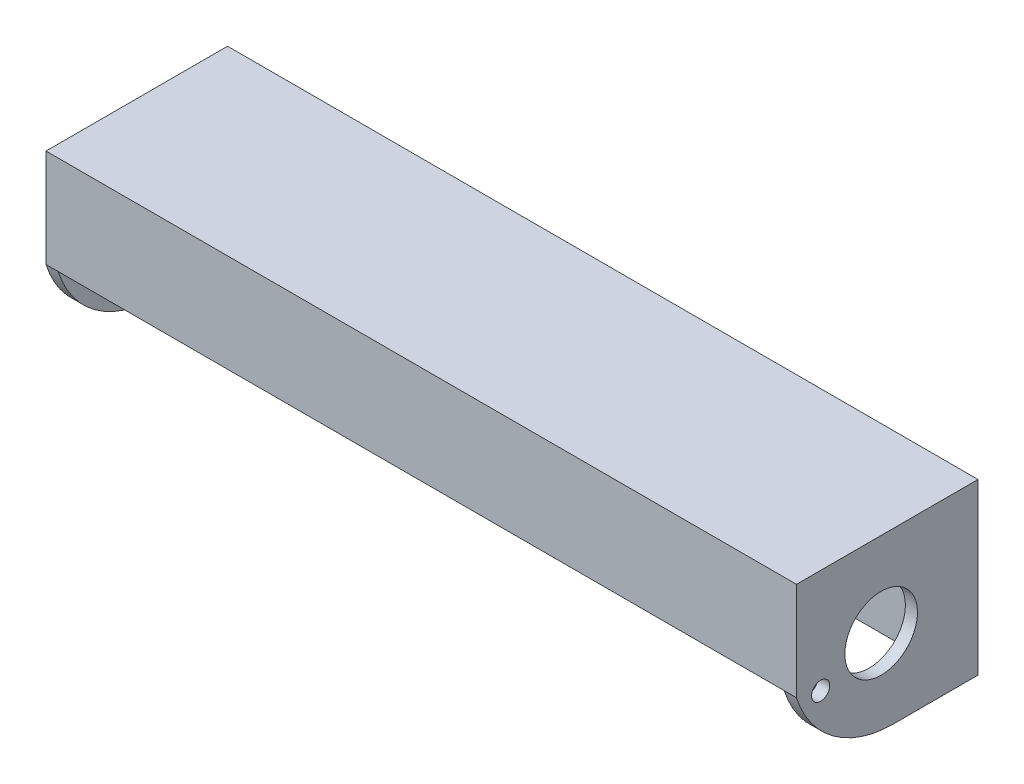
ISO-10303-21;
HEADER;
FILE_DESCRIPTION(('STEP AP214'),'2;1');
FILE_NAME('part.step','',(''),(''),'','','');
FILE_SCHEMA(('AUTOMOTIVE_DESIGN { 1 0 10303 214 1 1 1 1 }'));
ENDSEC;
DATA;
#1=APPLICATION_CONTEXT('core data for automotive mechanical design processes');
#2=APPLICATION_PROTOCOL_DEFINITION('international standard','automotive_design',2000,#1);
#3=PRODUCT_CONTEXT('',#1,'mechanical');
#4=PRODUCT('Part','Part','',(#3));
#5=PRODUCT_RELATED_PRODUCT_CATEGORY('part','',(#4));
#6=PRODUCT_DEFINITION_FORMATION('','',#4);
#7=PRODUCT_DEFINITION_CONTEXT('part definition',#1,'design');
#8=PRODUCT_DEFINITION('design','',#6,#7);
#9=PRODUCT_DEFINITION_SHAPE('','',#8);
#10=(LENGTH_UNIT() NAMED_UNIT(*) SI_UNIT(.MILLI.,.METRE.));
#11=(NAMED_UNIT(*) PLANE_ANGLE_UNIT() SI_UNIT($,.RADIAN.));
#12=(NAMED_UNIT(*) SI_UNIT($,.STERADIAN.) SOLID_ANGLE_UNIT());
#13=UNCERTAINTY_MEASURE_WITH_UNIT(LENGTH_MEASURE(1.E-05),#10,'distance_accuracy_value','');
#14=(GEOMETRIC_REPRESENTATION_CONTEXT(3) GLOBAL_UNCERTAINTY_ASSIGNED_CONTEXT((#13)) GLOBAL_UNIT_ASSIGNED_CONTEXT((#10,
#11,#12)) REPRESENTATION_CONTEXT('',''));
#15=CARTESIAN_POINT('',(0.,0.,0.));
#16=DIRECTION('',(0.,0.,1.));
#17=DIRECTION('',(1.,0.,0.));
#18=AXIS2_PLACEMENT_3D('',#15,#16,#17);
#19=CARTESIAN_POINT('',(0.,0.,25.4));
#20=DIRECTION('',(0.,0.,-1.));
#21=DIRECTION('',(-1.,0.,0.));
#22=AXIS2_PLACEMENT_3D('',#19,#20,#21);
#23=PLANE('',#22);
#24=DIRECTION('',(0.,1.,0.));
#25=VECTOR('',#24,1.);
#26=CARTESIAN_POINT('',(1499.21023765996,-7.62340036563071,25.4));
#27=LINE('',#26,#25);
#28=CARTESIAN_POINT('',(1499.21023765996,-7.62340036563049,25.4));
#29=VERTEX_POINT('',#28);
#30=CARTESIAN_POINT('',(1499.21023765996,335.276599634369,25.4));
#31=VERTEX_POINT('',#30);
#32=EDGE_CURVE('E11',#29,#31,#27,.T.);
#33=ORIENTED_EDGE('',*,*,#32,.T.);
#34=DIRECTION('',(-1.,0.,0.));
#35=VECTOR('',#34,1.);
#36=CARTESIAN_POINT('',(737.210237659963,335.276599634369,25.4));
#37=LINE('',#36,#35);
#38=CARTESIAN_POINT('',(-24.7897623400366,335.276599634369,25.4));
#39=VERTEX_POINT('',#38);
#40=EDGE_CURVE('E177',#31,#39,#37,.T.);
#41=ORIENTED_EDGE('',*,*,#40,.T.);
#42=DIRECTION('',(0.,-1.,0.));
#43=VECTOR('',#42,1.);
#44=CARTESIAN_POINT('',(-24.7897623400365,-7.62340036563071,25.4));
#45=LINE('',#44,#43);
#46=CARTESIAN_POINT('',(-24.7897623400365,-7.62340036563071,25.4));
#47=VERTEX_POINT('',#46);
#48=EDGE_CURVE('E133',#39,#47,#45,.T.);
#49=ORIENTED_EDGE('',*,*,#48,.T.);
#50=DIRECTION('',(1.,0.,0.));
#51=VECTOR('',#50,1.);
#52=CARTESIAN_POINT('',(-24.7897623400365,-7.62340036563071,25.4));
#53=LINE('',#52,#51);
#54=EDGE_CURVE('E42',#47,#29,#53,.T.);
#55=ORIENTED_EDGE('',*,*,#54,.T.);
#56=EDGE_LOOP('',(#33,#41,#49,#55));
#57=FACE_BOUND('',#56,.T.);
#58=ADVANCED_FACE('F33',(#57),#23,.F.);
#59=CARTESIAN_POINT('',(-24.7897623400366,205.227329694522,177.8));
#60=DIRECTION('',(-1.,0.,0.));
#61=DIRECTION('',(0.,-1.,0.));
#62=AXIS2_PLACEMENT_3D('',#59,#60,#61);
#63=PLANE('',#62);
#64=CARTESIAN_POINT('',(-24.7897623400366,129.161776851199,330.2));
#65=DIRECTION('',(-1.,0.,0.));
#66=DIRECTION('',(0.,-1.,0.));
#67=AXIS2_PLACEMENT_3D('',#64,#65,#66);
#68=CIRCLE('',#67,19.05);
#69=CARTESIAN_POINT('',(-24.7897623400366,110.111776851199,330.2));
#70=VERTEX_POINT('',#69);
#71=EDGE_CURVE('E224',#70,#70,#68,.T.);
#72=ORIENTED_EDGE('',*,*,#71,.T.);
#73=EDGE_LOOP('',(#72));
#74=FACE_BOUND('',#73,.T.);
#75=CARTESIAN_POINT('',(-24.7897623400366,170.176599634369,203.2));
#76=DIRECTION('',(-1.,0.,0.));
#77=DIRECTION('',(0.,-1.,0.));
#78=AXIS2_PLACEMENT_3D('',#75,#76,#77);
#79=CIRCLE('',#78,76.2);
#80=CARTESIAN_POINT('',(-24.7897623400366,93.9765996343693,203.2));
#81=VERTEX_POINT('',#80);
#82=EDGE_CURVE('E211',#81,#81,#79,.T.);
#83=ORIENTED_EDGE('',*,*,#82,.T.);
#84=EDGE_LOOP('',(#83));
#85=FACE_BOUND('',#84,.T.);
#86=DIRECTION('',(0.,0.,-1.));
#87=VECTOR('',#86,1.);
#88=CARTESIAN_POINT('',(-24.7897623400366,141.861776851199,381.));
#89=LINE('',#88,#87);
#90=CARTESIAN_POINT('',(-24.7897623400366,141.861776851199,381.));
#91=VERTEX_POINT('',#90);
#92=CARTESIAN_POINT('',(-24.7897623400366,141.861776851199,368.3));
#93=VERTEX_POINT('',#92);
#94=EDGE_CURVE('E170',#91,#93,#89,.T.);
#95=ORIENTED_EDGE('',*,*,#94,.F.);
#96=CARTESIAN_POINT('',(-24.7897623400366,205.227329694522,177.8));
#97=DIRECTION('',(-1.,0.,0.));
#98=DIRECTION('',(0.,-1.,0.));
#99=AXIS2_PLACEMENT_3D('',#96,#97,#98);
#100=CIRCLE('',#99,212.850730060153);
#101=CARTESIAN_POINT('',(-24.7897623400365,-7.62340036563072,177.8));
#102=VERTEX_POINT('',#101);
#103=EDGE_CURVE('E188',#102,#91,#100,.T.);
#104=ORIENTED_EDGE('',*,*,#103,.F.);
#105=DIRECTION('',(0.,0.,1.));
#106=VECTOR('',#105,1.);
#107=CARTESIAN_POINT('',(-24.7897623400365,-7.62340036563071,0.));
#108=LINE('',#107,#106);
#109=EDGE_CURVE('E185',#47,#102,#108,.T.);
#110=ORIENTED_EDGE('',*,*,#109,.F.);
#111=ORIENTED_EDGE('',*,*,#48,.F.);
#112=DIRECTION('',(0.,0.,-1.));
#113=VECTOR('',#112,1.);
#114=CARTESIAN_POINT('',(-24.7897623400366,335.276599634369,368.3));
#115=LINE('',#114,#113);
#116=CARTESIAN_POINT('',(-24.7897623400366,335.276599634369,368.3));
#117=VERTEX_POINT('',#116);
#118=EDGE_CURVE('E174',#117,#39,#115,.T.);
#119=ORIENTED_EDGE('',*,*,#118,.F.);
#120=DIRECTION('',(0.,1.,0.));
#121=VECTOR('',#120,1.);
#122=CARTESIAN_POINT('',(-24.7897623400366,141.861776851199,368.3));
#123=LINE('',#122,#121);
#124=EDGE_CURVE('E172',#93,#117,#123,.T.);
#125=ORIENTED_EDGE('',*,*,#124,.F.);
#126=EDGE_LOOP('',(#95,#104,#110,#111,#119,#125));
#127=FACE_BOUND('',#126,.T.);
#128=ADVANCED_FACE('F254',(#74,#85,#127),#63,.F.);
#129=CARTESIAN_POINT('',(-24.7897623400365,-7.62340036563071,25.4));
#130=DIRECTION('',(0.,1.,0.));
#131=DIRECTION('',(0.,0.,1.));
#132=AXIS2_PLACEMENT_3D('',#129,#130,#131);
#133=PLANE('',#132);
#134=DIRECTION('',(1.,0.,0.));
#135=VECTOR('',#134,1.);
#136=CARTESIAN_POINT('',(-24.7897623400365,-7.62340036563071,0.));
#137=LINE('',#136,#135);
#138=CARTESIAN_POINT('',(-50.1897623400366,-7.62340036563072,0.));
#139=VERTEX_POINT('',#138);
#140=CARTESIAN_POINT('',(1524.61023765996,-7.62340036563049,0.));
#141=VERTEX_POINT('',#140);
#142=EDGE_CURVE('E134',#139,#141,#137,.T.);
#143=ORIENTED_EDGE('',*,*,#142,.T.);
#144=DIRECTION('',(0.,0.,1.));
#145=VECTOR('',#144,1.);
#146=CARTESIAN_POINT('',(1524.61023765996,-7.62340036563049,0.));
#147=LINE('',#146,#145);
#148=CARTESIAN_POINT('',(1524.61023765996,-7.6234003656305,177.8));
#149=VERTEX_POINT('',#148);
#150=EDGE_CURVE('E144',#141,#149,#147,.T.);
#151=ORIENTED_EDGE('',*,*,#150,.T.);
#152=DIRECTION('',(-1.,0.,0.));
#153=VECTOR('',#152,1.);
#154=CARTESIAN_POINT('',(1524.61023765996,-7.6234003656305,177.8));
#155=LINE('',#154,#153);
#156=CARTESIAN_POINT('',(1499.21023765996,-7.6234003656305,177.8));
#157=VERTEX_POINT('',#156);
#158=EDGE_CURVE('E159',#149,#157,#155,.T.);
#159=ORIENTED_EDGE('',*,*,#158,.T.);
#160=DIRECTION('',(0.,0.,1.));
#161=VECTOR('',#160,1.);
#162=CARTESIAN_POINT('',(1499.21023765996,-7.62340036563049,0.));
#163=LINE('',#162,#161);
#164=EDGE_CURVE('E145',#29,#157,#163,.T.);
#165=ORIENTED_EDGE('',*,*,#164,.F.);
#166=ORIENTED_EDGE('',*,*,#54,.F.);
#167=ORIENTED_EDGE('',*,*,#109,.T.);
#168=DIRECTION('',(1.,0.,0.));
#169=VECTOR('',#168,1.);
#170=CARTESIAN_POINT('',(-50.1897623400366,-7.62340036563073,177.8));
#171=LINE('',#170,#169);
#172=CARTESIAN_POINT('',(-50.1897623400366,-7.62340036563073,177.8));
#173=VERTEX_POINT('',#172);
#174=EDGE_CURVE('E203',#173,#102,#171,.T.);
#175=ORIENTED_EDGE('',*,*,#174,.F.);
#176=DIRECTION('',(0.,0.,1.));
#177=VECTOR('',#176,1.);
#178=CARTESIAN_POINT('',(-50.1897623400366,-7.62340036563072,0.));
#179=LINE('',#178,#177);
#180=EDGE_CURVE('E187',#139,#173,#179,.T.);
#181=ORIENTED_EDGE('',*,*,#180,.F.);
#182=EDGE_LOOP('',(#143,#151,#159,#165,#166,#167,#175,#181));
#183=FACE_BOUND('',#182,.T.);
#184=ADVANCED_FACE('F35',(#183),#133,.F.);
#185=CARTESIAN_POINT('',(-24.7897623400366,347.976599634369,25.4));
#186=DIRECTION('',(0.,-1.,0.));
#187=DIRECTION('',(0.,0.,-1.));
#188=AXIS2_PLACEMENT_3D('',#185,#186,#187);
#189=PLANE('',#188);
#190=DIRECTION('',(1.,0.,0.));
#191=VECTOR('',#190,1.);
#192=CARTESIAN_POINT('',(-50.1897623400366,347.976599634369,381.));
#193=LINE('',#192,#191);
#194=CARTESIAN_POINT('',(-50.1897623400366,347.976599634369,381.));
#195=VERTEX_POINT('',#194);
#196=CARTESIAN_POINT('',(1524.61023765996,347.97659963437,381.));
#197=VERTEX_POINT('',#196);
#198=EDGE_CURVE('E149',#195,#197,#193,.T.);
#199=ORIENTED_EDGE('',*,*,#198,.T.);
#200=DIRECTION('',(0.,0.,-1.));
#201=VECTOR('',#200,1.);
#202=CARTESIAN_POINT('',(1524.61023765996,347.97659963437,0.));
#203=LINE('',#202,#201);
#204=CARTESIAN_POINT('',(1524.61023765996,347.97659963437,0.));
#205=VERTEX_POINT('',#204);
#206=EDGE_CURVE('E140',#197,#205,#203,.T.);
#207=ORIENTED_EDGE('',*,*,#206,.T.);
#208=DIRECTION('',(-1.,0.,0.));
#209=VECTOR('',#208,1.);
#210=CARTESIAN_POINT('',(-24.7897623400366,347.976599634369,0.));
#211=LINE('',#210,#209);
#212=CARTESIAN_POINT('',(-50.1897623400366,347.976599634369,0.));
#213=VERTEX_POINT('',#212);
#214=EDGE_CURVE('E122',#205,#213,#211,.T.);
#215=ORIENTED_EDGE('',*,*,#214,.T.);
#216=DIRECTION('',(0.,0.,-1.));
#217=VECTOR('',#216,1.);
#218=CARTESIAN_POINT('',(-50.1897623400366,347.976599634369,0.));
#219=LINE('',#218,#217);
#220=EDGE_CURVE('E194',#195,#213,#219,.T.);
#221=ORIENTED_EDGE('',*,*,#220,.F.);
#222=EDGE_LOOP('',(#199,#207,#215,#221));
#223=FACE_BOUND('',#222,.T.);
#224=ADVANCED_FACE('F147',(#223),#189,.F.);
#225=CARTESIAN_POINT('',(0.,0.,0.));
#226=DIRECTION('',(0.,0.,-1.));
#227=DIRECTION('',(-1.,0.,0.));
#228=AXIS2_PLACEMENT_3D('',#225,#226,#227);
#229=PLANE('',#228);
#230=ORIENTED_EDGE('',*,*,#142,.F.);
#231=DIRECTION('',(0.,-1.,0.));
#232=VECTOR('',#231,1.);
#233=CARTESIAN_POINT('',(-50.1897623400366,347.976599634369,0.));
#234=LINE('',#233,#232);
#235=EDGE_CURVE('E128',#213,#139,#234,.T.);
#236=ORIENTED_EDGE('',*,*,#235,.F.);
#237=ORIENTED_EDGE('',*,*,#214,.F.);
#238=DIRECTION('',(0.,-1.,0.));
#239=VECTOR('',#238,1.);
#240=CARTESIAN_POINT('',(1524.61023765996,347.97659963437,0.));
#241=LINE('',#240,#239);
#242=EDGE_CURVE('E125',#205,#141,#241,.T.);
#243=ORIENTED_EDGE('',*,*,#242,.T.);
#244=EDGE_LOOP('',(#230,#236,#237,#243));
#245=FACE_BOUND('',#244,.T.);
#246=ADVANCED_FACE('F124',(#245),#229,.T.);
#247=CARTESIAN_POINT('',(-50.1897623400366,205.227329694522,177.8));
#248=DIRECTION('',(1.,0.,0.));
#249=DIRECTION('',(0.,1.,0.));
#250=AXIS2_PLACEMENT_3D('',#247,#248,#249);
#251=CYLINDRICAL_SURFACE('',#250,212.850730060153);
#252=ORIENTED_EDGE('',*,*,#103,.T.);
#253=DIRECTION('',(1.,0.,0.));
#254=VECTOR('',#253,1.);
#255=CARTESIAN_POINT('',(-50.1897623400366,141.861776851199,381.));
#256=LINE('',#255,#254);
#257=CARTESIAN_POINT('',(-50.1897623400366,141.861776851199,381.));
#258=VERTEX_POINT('',#257);
#259=EDGE_CURVE('E200',#258,#91,#256,.T.);
#260=ORIENTED_EDGE('',*,*,#259,.F.);
#261=CARTESIAN_POINT('',(-50.1897623400366,205.227329694522,177.8));
#262=DIRECTION('',(-1.,0.,0.));
#263=DIRECTION('',(0.,-1.,0.));
#264=AXIS2_PLACEMENT_3D('',#261,#262,#263);
#265=CIRCLE('',#264,212.850730060153);
#266=EDGE_CURVE('E190',#173,#258,#265,.T.);
#267=ORIENTED_EDGE('',*,*,#266,.F.);
#268=ORIENTED_EDGE('',*,*,#174,.T.);
#269=EDGE_LOOP('',(#252,#260,#267,#268));
#270=FACE_BOUND('',#269,.T.);
#271=ADVANCED_FACE('F256',(#270),#251,.T.);
#272=CARTESIAN_POINT('',(-50.1897623400366,347.976599634369,381.));
#273=DIRECTION('',(0.,0.,-1.));
#274=DIRECTION('',(-1.,0.,0.));
#275=AXIS2_PLACEMENT_3D('',#272,#273,#274);
#276=PLANE('',#275);
#277=ORIENTED_EDGE('',*,*,#259,.T.);
#278=DIRECTION('',(-1.,0.,0.));
#279=VECTOR('',#278,1.);
#280=CARTESIAN_POINT('',(737.210237659963,141.861776851199,381.));
#281=LINE('',#280,#279);
#282=CARTESIAN_POINT('',(1499.21023765996,141.861776851199,381.));
#283=VERTEX_POINT('',#282);
#284=EDGE_CURVE('E182',#283,#91,#281,.T.);
#285=ORIENTED_EDGE('',*,*,#284,.F.);
#286=DIRECTION('',(-1.,0.,0.));
#287=VECTOR('',#286,1.);
#288=CARTESIAN_POINT('',(1524.61023765996,141.861776851199,381.));
#289=LINE('',#288,#287);
#290=CARTESIAN_POINT('',(1524.61023765996,141.861776851199,381.));
#291=VERTEX_POINT('',#290);
#292=EDGE_CURVE('E167',#291,#283,#289,.T.);
#293=ORIENTED_EDGE('',*,*,#292,.F.);
#294=DIRECTION('',(0.,1.,0.));
#295=VECTOR('',#294,1.);
#296=CARTESIAN_POINT('',(1524.61023765996,347.97659963437,381.));
#297=LINE('',#296,#295);
#298=EDGE_CURVE('E150',#291,#197,#297,.T.);
#299=ORIENTED_EDGE('',*,*,#298,.T.);
#300=ORIENTED_EDGE('',*,*,#198,.F.);
#301=DIRECTION('',(0.,1.,0.));
#302=VECTOR('',#301,1.);
#303=CARTESIAN_POINT('',(-50.1897623400366,347.976599634369,381.));
#304=LINE('',#303,#302);
#305=EDGE_CURVE('E192',#258,#195,#304,.T.);
#306=ORIENTED_EDGE('',*,*,#305,.F.);
#307=EDGE_LOOP('',(#277,#285,#293,#299,#300,#306));
#308=FACE_BOUND('',#307,.T.);
#309=ADVANCED_FACE('F249',(#308),#276,.F.);
#310=CARTESIAN_POINT('',(-50.1897623400366,205.227329694522,177.8));
#311=DIRECTION('',(-1.,0.,0.));
#312=DIRECTION('',(0.,-1.,0.));
#313=AXIS2_PLACEMENT_3D('',#310,#311,#312);
#314=PLANE('',#313);
#315=CARTESIAN_POINT('',(-50.1897623400366,129.161776851199,330.2));
#316=DIRECTION('',(-1.,0.,0.));
#317=DIRECTION('',(0.,-1.,0.));
#318=AXIS2_PLACEMENT_3D('',#315,#316,#317);
#319=CIRCLE('',#318,19.05);
#320=CARTESIAN_POINT('',(-50.1897623400366,110.111776851199,330.2));
#321=VERTEX_POINT('',#320);
#322=EDGE_CURVE('E418',#321,#321,#319,.T.);
#323=ORIENTED_EDGE('',*,*,#322,.F.);
#324=EDGE_LOOP('',(#323));
#325=FACE_BOUND('',#324,.T.);
#326=CARTESIAN_POINT('',(-50.1897623400366,170.176599634369,203.2));
#327=DIRECTION('',(-1.,0.,0.));
#328=DIRECTION('',(0.,-1.,0.));
#329=AXIS2_PLACEMENT_3D('',#326,#327,#328);
#330=CIRCLE('',#329,76.2);
#331=CARTESIAN_POINT('',(-50.1897623400366,93.9765996343693,203.2));
#332=VERTEX_POINT('',#331);
#333=EDGE_CURVE('E219',#332,#332,#330,.T.);
#334=ORIENTED_EDGE('',*,*,#333,.F.);
#335=EDGE_LOOP('',(#334));
#336=FACE_BOUND('',#335,.T.);
#337=ORIENTED_EDGE('',*,*,#235,.T.);
#338=ORIENTED_EDGE('',*,*,#180,.T.);
#339=ORIENTED_EDGE('',*,*,#266,.T.);
#340=ORIENTED_EDGE('',*,*,#305,.T.);
#341=ORIENTED_EDGE('',*,*,#220,.T.);
#342=EDGE_LOOP('',(#337,#338,#339,#340,#341));
#343=FACE_BOUND('',#342,.T.);
#344=ADVANCED_FACE('F260',(#325,#336,#343),#314,.T.);
#345=CARTESIAN_POINT('',(737.210237659963,141.861776851199,381.));
#346=DIRECTION('',(0.,1.,0.));
#347=DIRECTION('',(0.,0.,1.));
#348=AXIS2_PLACEMENT_3D('',#345,#346,#347);
#349=PLANE('',#348);
#350=ORIENTED_EDGE('',*,*,#94,.T.);
#351=DIRECTION('',(-1.,0.,0.));
#352=VECTOR('',#351,1.);
#353=CARTESIAN_POINT('',(737.210237659963,141.861776851199,368.3));
#354=LINE('',#353,#352);
#355=CARTESIAN_POINT('',(1499.21023765996,141.861776851199,368.3));
#356=VERTEX_POINT('',#355);
#357=EDGE_CURVE('E58',#356,#93,#354,.T.);
#358=ORIENTED_EDGE('',*,*,#357,.F.);
#359=DIRECTION('',(0.,0.,-1.));
#360=VECTOR('',#359,1.);
#361=CARTESIAN_POINT('',(1499.21023765996,141.861776851199,381.));
#362=LINE('',#361,#360);
#363=EDGE_CURVE('E163',#283,#356,#362,.T.);
#364=ORIENTED_EDGE('',*,*,#363,.F.);
#365=ORIENTED_EDGE('',*,*,#284,.T.);
#366=EDGE_LOOP('',(#350,#358,#364,#365));
#367=FACE_BOUND('',#366,.T.);
#368=ADVANCED_FACE('F252',(#367),#349,.F.);
#369=CARTESIAN_POINT('',(737.210237659963,141.861776851199,368.3));
#370=DIRECTION('',(0.,0.,1.));
#371=DIRECTION('',(1.,0.,0.));
#372=AXIS2_PLACEMENT_3D('',#369,#370,#371);
#373=PLANE('',#372);
#374=ORIENTED_EDGE('',*,*,#124,.T.);
#375=DIRECTION('',(-1.,0.,0.));
#376=VECTOR('',#375,1.);
#377=CARTESIAN_POINT('',(737.210237659963,335.276599634369,368.3));
#378=LINE('',#377,#376);
#379=CARTESIAN_POINT('',(1499.21023765996,335.276599634369,368.3));
#380=VERTEX_POINT('',#379);
#381=EDGE_CURVE('E50',#380,#117,#378,.T.);
#382=ORIENTED_EDGE('',*,*,#381,.F.);
#383=DIRECTION('',(0.,1.,0.));
#384=VECTOR('',#383,1.);
#385=CARTESIAN_POINT('',(1499.21023765996,141.861776851199,368.3));
#386=LINE('',#385,#384);
#387=EDGE_CURVE('E231',#356,#380,#386,.T.);
#388=ORIENTED_EDGE('',*,*,#387,.F.);
#389=ORIENTED_EDGE('',*,*,#357,.T.);
#390=EDGE_LOOP('',(#374,#382,#388,#389));
#391=FACE_BOUND('',#390,.T.);
#392=ADVANCED_FACE('F236',(#391),#373,.F.);
#393=CARTESIAN_POINT('',(737.210237659963,335.276599634369,368.3));
#394=DIRECTION('',(0.,1.,0.));
#395=DIRECTION('',(-1.,0.,0.));
#396=AXIS2_PLACEMENT_3D('',#393,#394,#395);
#397=PLANE('',#396);
#398=ORIENTED_EDGE('',*,*,#118,.T.);
#399=ORIENTED_EDGE('',*,*,#40,.F.);
#400=DIRECTION('',(0.,0.,-1.));
#401=VECTOR('',#400,1.);
#402=CARTESIAN_POINT('',(1499.21023765996,335.276599634369,368.3));
#403=LINE('',#402,#401);
#404=EDGE_CURVE('E216',#380,#31,#403,.T.);
#405=ORIENTED_EDGE('',*,*,#404,.F.);
#406=ORIENTED_EDGE('',*,*,#381,.T.);
#407=EDGE_LOOP('',(#398,#399,#405,#406));
#408=FACE_BOUND('',#407,.T.);
#409=ADVANCED_FACE('F239',(#408),#397,.F.);
#410=CARTESIAN_POINT('',(1524.61023765996,205.227329694522,177.8));
#411=DIRECTION('',(-1.,0.,0.));
#412=DIRECTION('',(0.,-1.,0.));
#413=AXIS2_PLACEMENT_3D('',#410,#411,#412);
#414=CYLINDRICAL_SURFACE('',#413,212.850730060153);
#415=CARTESIAN_POINT('',(1499.21023765996,205.227329694522,177.8));
#416=DIRECTION('',(-1.,0.,0.));
#417=DIRECTION('',(0.,-1.,0.));
#418=AXIS2_PLACEMENT_3D('',#415,#416,#417);
#419=CIRCLE('',#418,212.850730060153);
#420=EDGE_CURVE('E160',#157,#283,#419,.T.);
#421=ORIENTED_EDGE('',*,*,#420,.F.);
#422=ORIENTED_EDGE('',*,*,#158,.F.);
#423=CARTESIAN_POINT('',(1524.61023765996,205.227329694522,177.8));
#424=DIRECTION('',(-1.,0.,0.));
#425=DIRECTION('',(0.,-1.,0.));
#426=AXIS2_PLACEMENT_3D('',#423,#424,#425);
#427=CIRCLE('',#426,212.850730060153);
#428=EDGE_CURVE('E152',#149,#291,#427,.T.);
#429=ORIENTED_EDGE('',*,*,#428,.T.);
#430=ORIENTED_EDGE('',*,*,#292,.T.);
#431=EDGE_LOOP('',(#421,#422,#429,#430));
#432=FACE_BOUND('',#431,.T.);
#433=ADVANCED_FACE('F247',(#432),#414,.T.);
#434=CARTESIAN_POINT('',(1524.61023765996,205.227329694522,177.8));
#435=DIRECTION('',(1.,0.,0.));
#436=DIRECTION('',(0.,-1.,0.));
#437=AXIS2_PLACEMENT_3D('',#434,#435,#436);
#438=PLANE('',#437);
#439=CARTESIAN_POINT('',(1524.61023765996,129.161776851199,330.2));
#440=DIRECTION('',(-1.,0.,0.));
#441=DIRECTION('',(0.,-1.,0.));
#442=AXIS2_PLACEMENT_3D('',#439,#440,#441);
#443=CIRCLE('',#442,19.05);
#444=CARTESIAN_POINT('',(1524.61023765996,110.111776851199,330.2));
#445=VERTEX_POINT('',#444);
#446=EDGE_CURVE('E422',#445,#445,#443,.T.);
#447=ORIENTED_EDGE('',*,*,#446,.T.);
#448=EDGE_LOOP('',(#447));
#449=FACE_BOUND('',#448,.T.);
#450=CARTESIAN_POINT('',(1524.61023765996,170.176599634369,203.2));
#451=DIRECTION('',(-1.,0.,0.));
#452=DIRECTION('',(0.,-1.,0.));
#453=AXIS2_PLACEMENT_3D('',#450,#451,#452);
#454=CIRCLE('',#453,76.2);
#455=CARTESIAN_POINT('',(1524.61023765996,93.9765996343695,203.2));
#456=VERTEX_POINT('',#455);
#457=EDGE_CURVE('E212',#456,#456,#454,.T.);
#458=ORIENTED_EDGE('',*,*,#457,.T.);
#459=EDGE_LOOP('',(#458));
#460=FACE_BOUND('',#459,.T.);
#461=ORIENTED_EDGE('',*,*,#242,.F.);
#462=ORIENTED_EDGE('',*,*,#206,.F.);
#463=ORIENTED_EDGE('',*,*,#298,.F.);
#464=ORIENTED_EDGE('',*,*,#428,.F.);
#465=ORIENTED_EDGE('',*,*,#150,.F.);
#466=EDGE_LOOP('',(#461,#462,#463,#464,#465));
#467=FACE_BOUND('',#466,.T.);
#468=ADVANCED_FACE('F138',(#449,#460,#467),#438,.T.);
#469=CARTESIAN_POINT('',(1499.21023765996,205.227329694522,177.8));
#470=DIRECTION('',(1.,0.,0.));
#471=DIRECTION('',(0.,-1.,0.));
#472=AXIS2_PLACEMENT_3D('',#469,#470,#471);
#473=PLANE('',#472);
#474=CARTESIAN_POINT('',(1499.21023765996,129.161776851199,330.2));
#475=DIRECTION('',(1.,0.,0.));
#476=DIRECTION('',(0.,1.,0.));
#477=AXIS2_PLACEMENT_3D('',#474,#475,#476);
#478=CIRCLE('',#477,19.05);
#479=CARTESIAN_POINT('',(1499.21023765996,148.211776851199,330.2));
#480=VERTEX_POINT('',#479);
#481=EDGE_CURVE('E37',#480,#480,#478,.T.);
#482=ORIENTED_EDGE('',*,*,#481,.T.);
#483=EDGE_LOOP('',(#482));
#484=FACE_BOUND('',#483,.T.);
#485=CARTESIAN_POINT('',(1499.21023765996,170.176599634369,203.2));
#486=DIRECTION('',(1.,0.,0.));
#487=DIRECTION('',(0.,1.,0.));
#488=AXIS2_PLACEMENT_3D('',#485,#486,#487);
#489=CIRCLE('',#488,76.2);
#490=CARTESIAN_POINT('',(1499.21023765996,246.376599634369,203.2));
#491=VERTEX_POINT('',#490);
#492=EDGE_CURVE('E209',#491,#491,#489,.T.);
#493=ORIENTED_EDGE('',*,*,#492,.T.);
#494=EDGE_LOOP('',(#493));
#495=FACE_BOUND('',#494,.T.);
#496=ORIENTED_EDGE('',*,*,#387,.T.);
#497=ORIENTED_EDGE('',*,*,#404,.T.);
#498=ORIENTED_EDGE('',*,*,#32,.F.);
#499=ORIENTED_EDGE('',*,*,#164,.T.);
#500=ORIENTED_EDGE('',*,*,#420,.T.);
#501=ORIENTED_EDGE('',*,*,#363,.T.);
#502=EDGE_LOOP('',(#496,#497,#498,#499,#500,#501));
#503=FACE_BOUND('',#502,.T.);
#504=ADVANCED_FACE('F233',(#484,#495,#503),#473,.F.);
#505=CARTESIAN_POINT('',(1524.61023765996,170.176599634369,203.2));
#506=DIRECTION('',(-1.,0.,0.));
#507=DIRECTION('',(0.,-1.,0.));
#508=AXIS2_PLACEMENT_3D('',#505,#506,#507);
#509=CYLINDRICAL_SURFACE('',#508,76.2);
#510=ORIENTED_EDGE('',*,*,#457,.F.);
#511=EDGE_LOOP('',(#510));
#512=FACE_BOUND('',#511,.T.);
#513=ORIENTED_EDGE('',*,*,#492,.F.);
#514=EDGE_LOOP('',(#513));
#515=FACE_BOUND('',#514,.T.);
#516=ADVANCED_FACE('F306',(#512,#515),#509,.F.);
#517=ORIENTED_EDGE('',*,*,#333,.T.);
#518=EDGE_LOOP('',(#517));
#519=FACE_BOUND('',#518,.T.);
#520=ORIENTED_EDGE('',*,*,#82,.F.);
#521=EDGE_LOOP('',(#520));
#522=FACE_BOUND('',#521,.T.);
#523=ADVANCED_FACE('F300',(#519,#522),#509,.F.);
#524=CARTESIAN_POINT('',(1524.61023765996,129.161776851199,330.2));
#525=DIRECTION('',(-1.,0.,0.));
#526=DIRECTION('',(0.,-1.,0.));
#527=AXIS2_PLACEMENT_3D('',#524,#525,#526);
#528=CYLINDRICAL_SURFACE('',#527,19.05);
#529=ORIENTED_EDGE('',*,*,#446,.F.);
#530=EDGE_LOOP('',(#529));
#531=FACE_BOUND('',#530,.T.);
#532=ORIENTED_EDGE('',*,*,#481,.F.);
#533=EDGE_LOOP('',(#532));
#534=FACE_BOUND('',#533,.T.);
#535=ADVANCED_FACE('F305',(#531,#534),#528,.F.);
#536=ORIENTED_EDGE('',*,*,#322,.T.);
#537=EDGE_LOOP('',(#536));
#538=FACE_BOUND('',#537,.T.);
#539=ORIENTED_EDGE('',*,*,#71,.F.);
#540=EDGE_LOOP('',(#539));
#541=FACE_BOUND('',#540,.T.);
#542=ADVANCED_FACE('F403',(#538,#541),#528,.F.);
#543=CLOSED_SHELL('',(#58,#128,#184,#224,#246,#271,#309,#344,#368,#392,#409,#433,#468,#504,#516,
#523,#535,#542));
#544=MANIFOLD_SOLID_BREP('B2',#543);
#545=ADVANCED_BREP_SHAPE_REPRESENTATION('',(#18,#544),#14);
#546=SHAPE_DEFINITION_REPRESENTATION(#9,#545);
ENDSEC;
END-ISO-10303-21;
